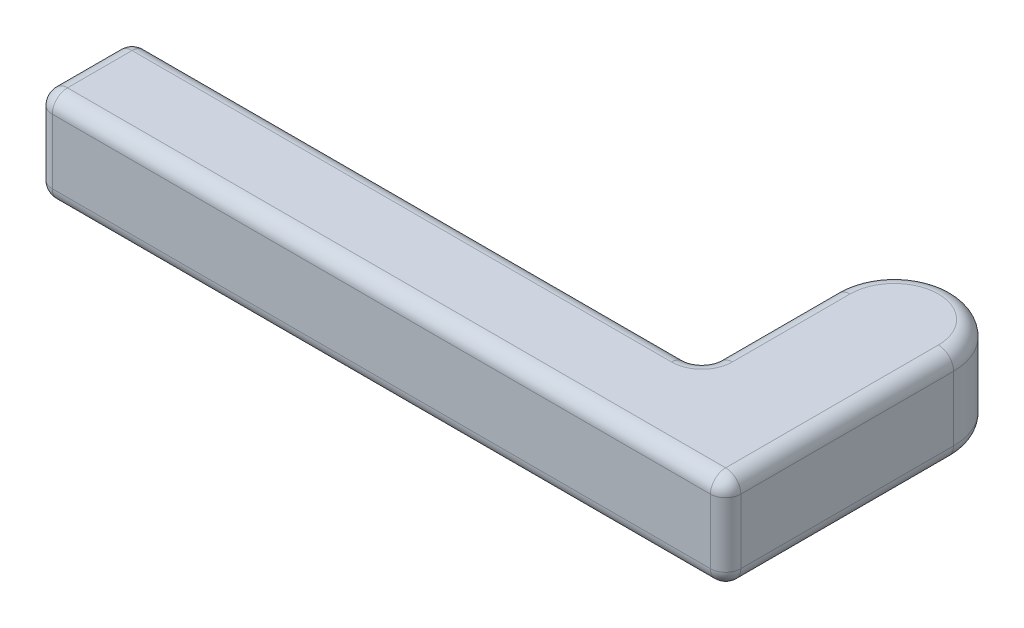
ISO-10303-21;
HEADER;
FILE_DESCRIPTION(('STEP AP214'),'2;1');
FILE_NAME('part.step','',(''),(''),'','','');
FILE_SCHEMA(('AUTOMOTIVE_DESIGN { 1 0 10303 214 1 1 1 1 }'));
ENDSEC;
DATA;
#1=APPLICATION_CONTEXT('core data for automotive mechanical design processes');
#2=APPLICATION_PROTOCOL_DEFINITION('international standard','automotive_design',2000,#1);
#3=PRODUCT_CONTEXT('',#1,'mechanical');
#4=PRODUCT('Part','Part','',(#3));
#5=PRODUCT_RELATED_PRODUCT_CATEGORY('part','',(#4));
#6=PRODUCT_DEFINITION_FORMATION('','',#4);
#7=PRODUCT_DEFINITION_CONTEXT('part definition',#1,'design');
#8=PRODUCT_DEFINITION('design','',#6,#7);
#9=PRODUCT_DEFINITION_SHAPE('','',#8);
#10=(LENGTH_UNIT() NAMED_UNIT(*) SI_UNIT(.MILLI.,.METRE.));
#11=(NAMED_UNIT(*) PLANE_ANGLE_UNIT() SI_UNIT($,.RADIAN.));
#12=(NAMED_UNIT(*) SI_UNIT($,.STERADIAN.) SOLID_ANGLE_UNIT());
#13=UNCERTAINTY_MEASURE_WITH_UNIT(LENGTH_MEASURE(1.E-05),#10,'distance_accuracy_value','');
#14=(GEOMETRIC_REPRESENTATION_CONTEXT(3) GLOBAL_UNCERTAINTY_ASSIGNED_CONTEXT((#13)) GLOBAL_UNIT_ASSIGNED_CONTEXT((#10,
#11,#12)) REPRESENTATION_CONTEXT('',''));
#15=CARTESIAN_POINT('',(0.,0.,0.));
#16=DIRECTION('',(0.,0.,1.));
#17=DIRECTION('',(1.,0.,0.));
#18=AXIS2_PLACEMENT_3D('',#15,#16,#17);
#19=CARTESIAN_POINT('',(70.7701006316034,12.7,-30.48));
#20=DIRECTION('',(0.,1.,0.));
#21=DIRECTION('',(0.,0.,1.));
#22=AXIS2_PLACEMENT_3D('',#19,#20,#21);
#23=PLANE('',#22);
#24=CARTESIAN_POINT('',(60.8006006316034,12.7,-14.732));
#25=DIRECTION('',(0.,1.,0.));
#26=DIRECTION('',(0.,0.,1.));
#27=AXIS2_PLACEMENT_3D('',#24,#25,#26);
#28=CIRCLE('',#27,4.064);
#29=CARTESIAN_POINT('',(60.8006006316034,12.7,-10.668));
#30=VERTEX_POINT('',#29);
#31=CARTESIAN_POINT('',(64.8646006316034,12.7,-14.732));
#32=VERTEX_POINT('',#31);
#33=EDGE_CURVE('E11',#30,#32,#28,.T.);
#34=ORIENTED_EDGE('',*,*,#33,.F.);
#35=DIRECTION('',(-1.,0.,0.));
#36=VECTOR('',#35,1.);
#37=CARTESIAN_POINT('',(-13.3673993683966,12.7,-10.668));
#38=LINE('',#37,#36);
#39=CARTESIAN_POINT('',(-11.3353993683966,12.7,-10.668));
#40=VERTEX_POINT('',#39);
#41=EDGE_CURVE('E55',#30,#40,#38,.T.);
#42=ORIENTED_EDGE('',*,*,#41,.T.);
#43=DIRECTION('',(0.,0.,1.));
#44=VECTOR('',#43,1.);
#45=CARTESIAN_POINT('',(-11.3353993683966,12.7,0.));
#46=LINE('',#45,#44);
#47=CARTESIAN_POINT('',(-11.3353993683966,12.7,-2.032));
#48=VERTEX_POINT('',#47);
#49=EDGE_CURVE('E282',#40,#48,#46,.T.);
#50=ORIENTED_EDGE('',*,*,#49,.T.);
#51=DIRECTION('',(1.,0.,0.));
#52=VECTOR('',#51,1.);
#53=CARTESIAN_POINT('',(78.7076006316034,12.7,-2.032));
#54=LINE('',#53,#52);
#55=CARTESIAN_POINT('',(76.6756006316034,12.7,-2.032));
#56=VERTEX_POINT('',#55);
#57=EDGE_CURVE('E285',#48,#56,#54,.T.);
#58=ORIENTED_EDGE('',*,*,#57,.T.);
#59=DIRECTION('',(0.,0.,-1.));
#60=VECTOR('',#59,1.);
#61=CARTESIAN_POINT('',(76.6756006316034,12.7,-30.48));
#62=LINE('',#61,#60);
#63=CARTESIAN_POINT('',(76.6756006316034,12.7,-30.48));
#64=VERTEX_POINT('',#63);
#65=EDGE_CURVE('E288',#56,#64,#62,.T.);
#66=ORIENTED_EDGE('',*,*,#65,.T.);
#67=CARTESIAN_POINT('',(70.7701006316034,12.7,-30.48));
#68=DIRECTION('',(0.,1.,0.));
#69=DIRECTION('',(0.,0.,1.));
#70=AXIS2_PLACEMENT_3D('',#67,#68,#69);
#71=CIRCLE('',#70,5.90550000000001);
#72=CARTESIAN_POINT('',(64.8646006316034,12.7,-30.48));
#73=VERTEX_POINT('',#72);
#74=EDGE_CURVE('E291',#64,#73,#71,.T.);
#75=ORIENTED_EDGE('',*,*,#74,.T.);
#76=DIRECTION('',(0.,0.,1.));
#77=VECTOR('',#76,1.);
#78=CARTESIAN_POINT('',(64.8646006316034,12.7,-12.7));
#79=LINE('',#78,#77);
#80=EDGE_CURVE('E66',#73,#32,#79,.T.);
#81=ORIENTED_EDGE('',*,*,#80,.T.);
#82=EDGE_LOOP('',(#34,#42,#50,#58,#66,#75,#81));
#83=FACE_BOUND('',#82,.T.);
#84=ADVANCED_FACE('F45',(#83),#23,.T.);
#85=CARTESIAN_POINT('',(-13.3673993683966,12.7,-12.7));
#86=DIRECTION('',(1.,0.,0.));
#87=DIRECTION('',(0.,0.,-1.));
#88=AXIS2_PLACEMENT_3D('',#85,#86,#87);
#89=PLANE('',#88);
#90=DIRECTION('',(0.,0.,1.));
#91=VECTOR('',#90,1.);
#92=CARTESIAN_POINT('',(-13.3673993683966,2.032,-12.7));
#93=LINE('',#92,#91);
#94=CARTESIAN_POINT('',(-13.3673993683966,2.032,-10.668));
#95=VERTEX_POINT('',#94);
#96=CARTESIAN_POINT('',(-13.3673993683966,2.032,-2.032));
#97=VERTEX_POINT('',#96);
#98=EDGE_CURVE('E275',#95,#97,#93,.T.);
#99=ORIENTED_EDGE('',*,*,#98,.T.);
#100=DIRECTION('',(0.,-1.,0.));
#101=VECTOR('',#100,1.);
#102=CARTESIAN_POINT('',(-13.3673993683966,12.7,-2.032));
#103=LINE('',#102,#101);
#104=CARTESIAN_POINT('',(-13.3673993683966,10.668,-2.032));
#105=VERTEX_POINT('',#104);
#106=EDGE_CURVE('E279',#97,#105,#103,.F.);
#107=ORIENTED_EDGE('',*,*,#106,.T.);
#108=DIRECTION('',(0.,0.,1.));
#109=VECTOR('',#108,1.);
#110=CARTESIAN_POINT('',(-13.3673993683966,10.668,-12.7));
#111=LINE('',#110,#109);
#112=CARTESIAN_POINT('',(-13.3673993683966,10.668,-10.668));
#113=VERTEX_POINT('',#112);
#114=EDGE_CURVE('E272',#105,#113,#111,.F.);
#115=ORIENTED_EDGE('',*,*,#114,.T.);
#116=DIRECTION('',(0.,-1.,0.));
#117=VECTOR('',#116,1.);
#118=CARTESIAN_POINT('',(-13.3673993683966,12.7,-10.668));
#119=LINE('',#118,#117);
#120=EDGE_CURVE('E269',#113,#95,#119,.T.);
#121=ORIENTED_EDGE('',*,*,#120,.T.);
#122=EDGE_LOOP('',(#99,#107,#115,#121));
#123=FACE_BOUND('',#122,.T.);
#124=ADVANCED_FACE('F466',(#123),#89,.F.);
#125=CARTESIAN_POINT('',(-13.3673993683966,12.7,0.));
#126=DIRECTION('',(0.,0.,-1.));
#127=DIRECTION('',(-1.,0.,0.));
#128=AXIS2_PLACEMENT_3D('',#125,#126,#127);
#129=PLANE('',#128);
#130=DIRECTION('',(1.,0.,0.));
#131=VECTOR('',#130,1.);
#132=CARTESIAN_POINT('',(-13.3673993683966,10.668,0.));
#133=LINE('',#132,#131);
#134=CARTESIAN_POINT('',(76.6756006316034,10.668,0.));
#135=VERTEX_POINT('',#134);
#136=CARTESIAN_POINT('',(-11.3353993683966,10.668,0.));
#137=VERTEX_POINT('',#136);
#138=EDGE_CURVE('E196',#135,#137,#133,.F.);
#139=ORIENTED_EDGE('',*,*,#138,.T.);
#140=DIRECTION('',(0.,-1.,0.));
#141=VECTOR('',#140,1.);
#142=CARTESIAN_POINT('',(-11.3353993683966,12.7,0.));
#143=LINE('',#142,#141);
#144=CARTESIAN_POINT('',(-11.3353993683966,2.032,0.));
#145=VERTEX_POINT('',#144);
#146=EDGE_CURVE('E201',#137,#145,#143,.T.);
#147=ORIENTED_EDGE('',*,*,#146,.T.);
#148=DIRECTION('',(1.,0.,0.));
#149=VECTOR('',#148,1.);
#150=CARTESIAN_POINT('',(-13.3673993683966,2.032,0.));
#151=LINE('',#150,#149);
#152=CARTESIAN_POINT('',(76.6756006316034,2.032,0.));
#153=VERTEX_POINT('',#152);
#154=EDGE_CURVE('E169',#145,#153,#151,.T.);
#155=ORIENTED_EDGE('',*,*,#154,.T.);
#156=DIRECTION('',(0.,-1.,0.));
#157=VECTOR('',#156,1.);
#158=CARTESIAN_POINT('',(76.6756006316034,12.7,0.));
#159=LINE('',#158,#157);
#160=EDGE_CURVE('E189',#153,#135,#159,.F.);
#161=ORIENTED_EDGE('',*,*,#160,.T.);
#162=EDGE_LOOP('',(#139,#147,#155,#161));
#163=FACE_BOUND('',#162,.T.);
#164=ADVANCED_FACE('F199',(#163),#129,.F.);
#165=CARTESIAN_POINT('',(78.7076006316034,12.7,-30.48));
#166=DIRECTION('',(-1.,0.,0.));
#167=DIRECTION('',(0.,0.,1.));
#168=AXIS2_PLACEMENT_3D('',#165,#166,#167);
#169=PLANE('',#168);
#170=DIRECTION('',(0.,-1.,0.));
#171=VECTOR('',#170,1.);
#172=CARTESIAN_POINT('',(78.7076006316034,12.7,-2.032));
#173=LINE('',#172,#171);
#174=CARTESIAN_POINT('',(78.7076006316034,10.668,-2.032));
#175=VERTEX_POINT('',#174);
#176=CARTESIAN_POINT('',(78.7076006316034,2.032,-2.032));
#177=VERTEX_POINT('',#176);
#178=EDGE_CURVE('E231',#175,#177,#173,.T.);
#179=ORIENTED_EDGE('',*,*,#178,.T.);
#180=DIRECTION('',(0.,0.,-1.));
#181=VECTOR('',#180,1.);
#182=CARTESIAN_POINT('',(78.7076006316034,2.032,-30.48));
#183=LINE('',#182,#181);
#184=CARTESIAN_POINT('',(78.7076006316034,2.032,-30.48));
#185=VERTEX_POINT('',#184);
#186=EDGE_CURVE('E237',#177,#185,#183,.T.);
#187=ORIENTED_EDGE('',*,*,#186,.T.);
#188=DIRECTION('',(0.,-1.,0.));
#189=VECTOR('',#188,1.);
#190=CARTESIAN_POINT('',(78.7076006316034,12.7,-30.48));
#191=LINE('',#190,#189);
#192=CARTESIAN_POINT('',(78.7076006316034,10.668,-30.48));
#193=VERTEX_POINT('',#192);
#194=EDGE_CURVE('E197',#193,#185,#191,.T.);
#195=ORIENTED_EDGE('',*,*,#194,.F.);
#196=DIRECTION('',(0.,0.,-1.));
#197=VECTOR('',#196,1.);
#198=CARTESIAN_POINT('',(78.7076006316034,10.668,0.));
#199=LINE('',#198,#197);
#200=EDGE_CURVE('E234',#193,#175,#199,.F.);
#201=ORIENTED_EDGE('',*,*,#200,.T.);
#202=EDGE_LOOP('',(#179,#187,#195,#201));
#203=FACE_BOUND('',#202,.T.);
#204=ADVANCED_FACE('F412',(#203),#169,.F.);
#205=CARTESIAN_POINT('',(70.7701006316034,12.7,-30.48));
#206=DIRECTION('',(0.,-1.,0.));
#207=DIRECTION('',(0.,0.,-1.));
#208=AXIS2_PLACEMENT_3D('',#205,#206,#207);
#209=CYLINDRICAL_SURFACE('',#208,7.93750000000001);
#210=ORIENTED_EDGE('',*,*,#194,.T.);
#211=CARTESIAN_POINT('',(70.7701006316034,2.032,-30.48));
#212=DIRECTION('',(0.,1.,0.));
#213=DIRECTION('',(0.,0.,1.));
#214=AXIS2_PLACEMENT_3D('',#211,#212,#213);
#215=CIRCLE('',#214,7.93750000000001);
#216=CARTESIAN_POINT('',(62.8326006316034,2.032,-30.48));
#217=VERTEX_POINT('',#216);
#218=EDGE_CURVE('E244',#185,#217,#215,.T.);
#219=ORIENTED_EDGE('',*,*,#218,.T.);
#220=DIRECTION('',(0.,-1.,0.));
#221=VECTOR('',#220,1.);
#222=CARTESIAN_POINT('',(62.8326006316034,12.7,-30.48));
#223=LINE('',#222,#221);
#224=CARTESIAN_POINT('',(62.8326006316034,10.668,-30.48));
#225=VERTEX_POINT('',#224);
#226=EDGE_CURVE('E391',#225,#217,#223,.T.);
#227=ORIENTED_EDGE('',*,*,#226,.F.);
#228=CARTESIAN_POINT('',(70.7701006316034,10.668,-30.48));
#229=DIRECTION('',(0.,1.,0.));
#230=DIRECTION('',(0.,0.,1.));
#231=AXIS2_PLACEMENT_3D('',#228,#229,#230);
#232=CIRCLE('',#231,7.93750000000001);
#233=EDGE_CURVE('E241',#225,#193,#232,.F.);
#234=ORIENTED_EDGE('',*,*,#233,.T.);
#235=EDGE_LOOP('',(#210,#219,#227,#234));
#236=FACE_BOUND('',#235,.T.);
#237=ADVANCED_FACE('F407',(#236),#209,.T.);
#238=CARTESIAN_POINT('',(62.8326006316034,12.7,-12.7));
#239=DIRECTION('',(1.,0.,0.));
#240=DIRECTION('',(0.,0.,-1.));
#241=AXIS2_PLACEMENT_3D('',#238,#239,#240);
#242=PLANE('',#241);
#243=ORIENTED_EDGE('',*,*,#226,.T.);
#244=DIRECTION('',(0.,0.,1.));
#245=VECTOR('',#244,1.);
#246=CARTESIAN_POINT('',(62.8326006316034,2.032,-12.7));
#247=LINE('',#246,#245);
#248=CARTESIAN_POINT('',(62.8326006316034,2.032,-14.732));
#249=VERTEX_POINT('',#248);
#250=EDGE_CURVE('E253',#217,#249,#247,.T.);
#251=ORIENTED_EDGE('',*,*,#250,.T.);
#252=DIRECTION('',(0.,-1.,0.));
#253=VECTOR('',#252,1.);
#254=CARTESIAN_POINT('',(62.8326006316034,12.7,-14.732));
#255=LINE('',#254,#253);
#256=CARTESIAN_POINT('',(62.8326006316034,10.668,-14.732));
#257=VERTEX_POINT('',#256);
#258=EDGE_CURVE('E247',#249,#257,#255,.F.);
#259=ORIENTED_EDGE('',*,*,#258,.T.);
#260=DIRECTION('',(0.,0.,1.));
#261=VECTOR('',#260,1.);
#262=CARTESIAN_POINT('',(62.8326006316034,10.668,-30.48));
#263=LINE('',#262,#261);
#264=EDGE_CURVE('E250',#257,#225,#263,.F.);
#265=ORIENTED_EDGE('',*,*,#264,.T.);
#266=EDGE_LOOP('',(#243,#251,#259,#265));
#267=FACE_BOUND('',#266,.T.);
#268=ADVANCED_FACE('F438',(#267),#242,.F.);
#269=CARTESIAN_POINT('',(62.8326006316034,12.7,-12.7));
#270=DIRECTION('',(0.,0.,1.));
#271=DIRECTION('',(1.,0.,0.));
#272=AXIS2_PLACEMENT_3D('',#269,#270,#271);
#273=PLANE('',#272);
#274=DIRECTION('',(-1.,0.,0.));
#275=VECTOR('',#274,1.);
#276=CARTESIAN_POINT('',(62.8326006316034,2.032,-12.7));
#277=LINE('',#276,#275);
#278=CARTESIAN_POINT('',(60.8006006316034,2.032,-12.7));
#279=VERTEX_POINT('',#278);
#280=CARTESIAN_POINT('',(-11.3353993683966,2.032,-12.7));
#281=VERTEX_POINT('',#280);
#282=EDGE_CURVE('E262',#279,#281,#277,.T.);
#283=ORIENTED_EDGE('',*,*,#282,.T.);
#284=DIRECTION('',(0.,-1.,0.));
#285=VECTOR('',#284,1.);
#286=CARTESIAN_POINT('',(-11.3353993683966,12.7,-12.7));
#287=LINE('',#286,#285);
#288=CARTESIAN_POINT('',(-11.3353993683966,10.668,-12.7));
#289=VERTEX_POINT('',#288);
#290=EDGE_CURVE('E266',#281,#289,#287,.F.);
#291=ORIENTED_EDGE('',*,*,#290,.T.);
#292=DIRECTION('',(-1.,0.,0.));
#293=VECTOR('',#292,1.);
#294=CARTESIAN_POINT('',(62.8326006316034,10.668,-12.7));
#295=LINE('',#294,#293);
#296=CARTESIAN_POINT('',(60.8006006316034,10.668,-12.7));
#297=VERTEX_POINT('',#296);
#298=EDGE_CURVE('E259',#289,#297,#295,.F.);
#299=ORIENTED_EDGE('',*,*,#298,.T.);
#300=DIRECTION('',(0.,-1.,0.));
#301=VECTOR('',#300,1.);
#302=CARTESIAN_POINT('',(60.8006006316034,0.,-12.7));
#303=LINE('',#302,#301);
#304=EDGE_CURVE('E256',#297,#279,#303,.T.);
#305=ORIENTED_EDGE('',*,*,#304,.T.);
#306=EDGE_LOOP('',(#283,#291,#299,#305));
#307=FACE_BOUND('',#306,.T.);
#308=ADVANCED_FACE('F453',(#307),#273,.F.);
#309=CARTESIAN_POINT('',(70.7701006316034,0.,-30.48));
#310=DIRECTION('',(0.,1.,0.));
#311=DIRECTION('',(0.,0.,1.));
#312=AXIS2_PLACEMENT_3D('',#309,#310,#311);
#313=PLANE('',#312);
#314=CARTESIAN_POINT('',(70.7701006316034,0.,-30.48));
#315=DIRECTION('',(0.,1.,0.));
#316=DIRECTION('',(0.,0.,1.));
#317=AXIS2_PLACEMENT_3D('',#314,#315,#316);
#318=CIRCLE('',#317,5.90550000000001);
#319=CARTESIAN_POINT('',(64.8646006316034,0.,-30.48));
#320=VERTEX_POINT('',#319);
#321=CARTESIAN_POINT('',(76.6756006316034,0.,-30.48));
#322=VERTEX_POINT('',#321);
#323=EDGE_CURVE('E225',#320,#322,#318,.F.);
#324=ORIENTED_EDGE('',*,*,#323,.T.);
#325=DIRECTION('',(0.,0.,-1.));
#326=VECTOR('',#325,1.);
#327=CARTESIAN_POINT('',(76.6756006316034,0.,-30.48));
#328=LINE('',#327,#326);
#329=CARTESIAN_POINT('',(76.6756006316034,0.,-2.032));
#330=VERTEX_POINT('',#329);
#331=EDGE_CURVE('E228',#322,#330,#328,.F.);
#332=ORIENTED_EDGE('',*,*,#331,.T.);
#333=DIRECTION('',(1.,0.,0.));
#334=VECTOR('',#333,1.);
#335=CARTESIAN_POINT('',(70.7701006316034,0.,-2.032));
#336=LINE('',#335,#334);
#337=CARTESIAN_POINT('',(-11.3353993683966,0.,-2.032));
#338=VERTEX_POINT('',#337);
#339=EDGE_CURVE('E171',#330,#338,#336,.F.);
#340=ORIENTED_EDGE('',*,*,#339,.T.);
#341=DIRECTION('',(0.,0.,1.));
#342=VECTOR('',#341,1.);
#343=CARTESIAN_POINT('',(-11.3353993683966,0.,-30.48));
#344=LINE('',#343,#342);
#345=CARTESIAN_POINT('',(-11.3353993683966,0.,-10.668));
#346=VERTEX_POINT('',#345);
#347=EDGE_CURVE('E207',#338,#346,#344,.F.);
#348=ORIENTED_EDGE('',*,*,#347,.T.);
#349=DIRECTION('',(-1.,0.,0.));
#350=VECTOR('',#349,1.);
#351=CARTESIAN_POINT('',(70.7701006316034,0.,-10.668));
#352=LINE('',#351,#350);
#353=CARTESIAN_POINT('',(60.8006006316034,0.,-10.668));
#354=VERTEX_POINT('',#353);
#355=EDGE_CURVE('E213',#346,#354,#352,.F.);
#356=ORIENTED_EDGE('',*,*,#355,.T.);
#357=CARTESIAN_POINT('',(60.8006006316034,0.,-14.732));
#358=DIRECTION('',(0.,1.,0.));
#359=DIRECTION('',(0.,0.,1.));
#360=AXIS2_PLACEMENT_3D('',#357,#358,#359);
#361=CIRCLE('',#360,4.064);
#362=CARTESIAN_POINT('',(64.8646006316034,0.,-14.732));
#363=VERTEX_POINT('',#362);
#364=EDGE_CURVE('E218',#363,#354,#361,.F.);
#365=ORIENTED_EDGE('',*,*,#364,.F.);
#366=DIRECTION('',(0.,0.,1.));
#367=VECTOR('',#366,1.);
#368=CARTESIAN_POINT('',(64.8646006316034,0.,-30.48));
#369=LINE('',#368,#367);
#370=EDGE_CURVE('E222',#363,#320,#369,.F.);
#371=ORIENTED_EDGE('',*,*,#370,.T.);
#372=EDGE_LOOP('',(#324,#332,#340,#348,#356,#365,#371));
#373=FACE_BOUND('',#372,.T.);
#374=ADVANCED_FACE('F490',(#373),#313,.F.);
#375=CARTESIAN_POINT('',(60.8006006316034,10.668,-14.732));
#376=DIRECTION('',(0.,1.,0.));
#377=DIRECTION('',(0.,0.,1.));
#378=AXIS2_PLACEMENT_3D('',#375,#376,#377);
#379=TOROIDAL_SURFACE('',#378,4.064,2.032);
#380=CARTESIAN_POINT('',(60.8006006316034,10.668,-14.732));
#381=DIRECTION('',(0.,1.,0.));
#382=DIRECTION('',(0.,0.,1.));
#383=AXIS2_PLACEMENT_3D('',#380,#381,#382);
#384=CIRCLE('',#383,2.032);
#385=EDGE_CURVE('E380',#297,#257,#384,.T.);
#386=ORIENTED_EDGE('',*,*,#385,.F.);
#387=CARTESIAN_POINT('',(60.8006006316034,10.668,-10.668));
#388=DIRECTION('',(1.,0.,0.));
#389=DIRECTION('',(0.,0.,-1.));
#390=AXIS2_PLACEMENT_3D('',#387,#388,#389);
#391=CIRCLE('',#390,2.032);
#392=EDGE_CURVE('E49',#30,#297,#391,.F.);
#393=ORIENTED_EDGE('',*,*,#392,.F.);
#394=ORIENTED_EDGE('',*,*,#33,.T.);
#395=CARTESIAN_POINT('',(64.8646006316034,10.668,-14.732));
#396=DIRECTION('',(0.,0.,1.));
#397=DIRECTION('',(1.,0.,0.));
#398=AXIS2_PLACEMENT_3D('',#395,#396,#397);
#399=CIRCLE('',#398,2.032);
#400=EDGE_CURVE('E383',#257,#32,#399,.F.);
#401=ORIENTED_EDGE('',*,*,#400,.F.);
#402=EDGE_LOOP('',(#386,#393,#394,#401));
#403=FACE_BOUND('',#402,.T.);
#404=ADVANCED_FACE('F47',(#403),#379,.T.);
#405=CARTESIAN_POINT('',(70.7701006316034,10.668,-10.668));
#406=DIRECTION('',(1.,0.,0.));
#407=DIRECTION('',(0.,0.,-1.));
#408=AXIS2_PLACEMENT_3D('',#405,#406,#407);
#409=CYLINDRICAL_SURFACE('',#408,2.032);
#410=ORIENTED_EDGE('',*,*,#392,.T.);
#411=ORIENTED_EDGE('',*,*,#298,.F.);
#412=CARTESIAN_POINT('',(-11.3353993683966,10.668,-10.668));
#413=DIRECTION('',(-1.,0.,0.));
#414=DIRECTION('',(0.,0.,1.));
#415=AXIS2_PLACEMENT_3D('',#412,#413,#414);
#416=CIRCLE('',#415,2.032);
#417=EDGE_CURVE('E376',#40,#289,#416,.T.);
#418=ORIENTED_EDGE('',*,*,#417,.F.);
#419=ORIENTED_EDGE('',*,*,#41,.F.);
#420=EDGE_LOOP('',(#410,#411,#418,#419));
#421=FACE_BOUND('',#420,.T.);
#422=ADVANCED_FACE('F455',(#421),#409,.T.);
#423=CARTESIAN_POINT('',(64.8646006316034,10.668,-30.48));
#424=DIRECTION('',(0.,0.,-1.));
#425=DIRECTION('',(-1.,0.,0.));
#426=AXIS2_PLACEMENT_3D('',#423,#424,#425);
#427=CYLINDRICAL_SURFACE('',#426,2.032);
#428=ORIENTED_EDGE('',*,*,#400,.T.);
#429=ORIENTED_EDGE('',*,*,#80,.F.);
#430=CARTESIAN_POINT('',(64.8646006316034,10.668,-30.48));
#431=DIRECTION('',(0.,0.,-1.));
#432=DIRECTION('',(-1.,0.,0.));
#433=AXIS2_PLACEMENT_3D('',#430,#431,#432);
#434=CIRCLE('',#433,2.032);
#435=EDGE_CURVE('E372',#225,#73,#434,.T.);
#436=ORIENTED_EDGE('',*,*,#435,.F.);
#437=ORIENTED_EDGE('',*,*,#264,.F.);
#438=EDGE_LOOP('',(#428,#429,#436,#437));
#439=FACE_BOUND('',#438,.T.);
#440=ADVANCED_FACE('F667',(#439),#427,.T.);
#441=CARTESIAN_POINT('',(60.8006006316034,12.7,-14.732));
#442=DIRECTION('',(0.,1.,0.));
#443=DIRECTION('',(0.,0.,1.));
#444=AXIS2_PLACEMENT_3D('',#441,#442,#443);
#445=CYLINDRICAL_SURFACE('',#444,2.032);
#446=ORIENTED_EDGE('',*,*,#385,.T.);
#447=ORIENTED_EDGE('',*,*,#258,.F.);
#448=CARTESIAN_POINT('',(60.8006006316034,2.032,-14.732));
#449=DIRECTION('',(0.,1.,0.));
#450=DIRECTION('',(0.,0.,1.));
#451=AXIS2_PLACEMENT_3D('',#448,#449,#450);
#452=CIRCLE('',#451,2.032);
#453=EDGE_CURVE('E368',#279,#249,#452,.T.);
#454=ORIENTED_EDGE('',*,*,#453,.F.);
#455=ORIENTED_EDGE('',*,*,#304,.F.);
#456=EDGE_LOOP('',(#446,#447,#454,#455));
#457=FACE_BOUND('',#456,.T.);
#458=ADVANCED_FACE('F441',(#457),#445,.F.);
#459=CARTESIAN_POINT('',(-11.3353993683966,10.668,-10.668));
#460=DIRECTION('',(0.,0.,-1.));
#461=DIRECTION('',(-1.,0.,0.));
#462=AXIS2_PLACEMENT_3D('',#459,#460,#461);
#463=SPHERICAL_SURFACE('',#462,2.032);
#464=CARTESIAN_POINT('',(-11.3353993683966,10.668,-10.668));
#465=DIRECTION('',(0.,0.,-1.));
#466=DIRECTION('',(0.,1.,0.));
#467=AXIS2_PLACEMENT_3D('',#464,#465,#466);
#468=CIRCLE('',#467,2.032);
#469=EDGE_CURVE('E356',#40,#113,#468,.F.);
#470=ORIENTED_EDGE('',*,*,#469,.F.);
#471=ORIENTED_EDGE('',*,*,#417,.T.);
#472=CARTESIAN_POINT('',(-11.3353993683966,10.668,-10.668));
#473=DIRECTION('',(0.,1.,0.));
#474=DIRECTION('',(0.,0.,1.));
#475=AXIS2_PLACEMENT_3D('',#472,#473,#474);
#476=CIRCLE('',#475,2.032);
#477=EDGE_CURVE('E360',#113,#289,#476,.F.);
#478=ORIENTED_EDGE('',*,*,#477,.F.);
#479=EDGE_LOOP('',(#470,#471,#478));
#480=FACE_BOUND('',#479,.T.);
#481=ADVANCED_FACE('F459',(#480),#463,.T.);
#482=CARTESIAN_POINT('',(70.7701006316034,10.668,-30.48));
#483=DIRECTION('',(0.,1.,0.));
#484=DIRECTION('',(0.,0.,1.));
#485=AXIS2_PLACEMENT_3D('',#482,#483,#484);
#486=TOROIDAL_SURFACE('',#485,5.90550000000001,2.032);
#487=ORIENTED_EDGE('',*,*,#435,.T.);
#488=ORIENTED_EDGE('',*,*,#74,.F.);
#489=CARTESIAN_POINT('',(76.6756006316034,10.668,-30.48));
#490=DIRECTION('',(0.,0.,1.));
#491=DIRECTION('',(1.,0.,0.));
#492=AXIS2_PLACEMENT_3D('',#489,#490,#491);
#493=CIRCLE('',#492,2.032);
#494=EDGE_CURVE('E352',#193,#64,#493,.T.);
#495=ORIENTED_EDGE('',*,*,#494,.F.);
#496=ORIENTED_EDGE('',*,*,#233,.F.);
#497=EDGE_LOOP('',(#487,#488,#495,#496));
#498=FACE_BOUND('',#497,.T.);
#499=ADVANCED_FACE('F418',(#498),#486,.T.);
#500=CARTESIAN_POINT('',(60.8006006316034,2.032,-14.732));
#501=DIRECTION('',(0.,1.,0.));
#502=DIRECTION('',(0.,0.,1.));
#503=AXIS2_PLACEMENT_3D('',#500,#501,#502);
#504=TOROIDAL_SURFACE('',#503,4.064,2.032);
#505=CARTESIAN_POINT('',(64.8646006316034,2.032,-14.732));
#506=DIRECTION('',(0.,0.,1.));
#507=DIRECTION('',(1.,0.,0.));
#508=AXIS2_PLACEMENT_3D('',#505,#506,#507);
#509=CIRCLE('',#508,2.032);
#510=EDGE_CURVE('E348',#363,#249,#509,.F.);
#511=ORIENTED_EDGE('',*,*,#510,.F.);
#512=ORIENTED_EDGE('',*,*,#364,.T.);
#513=CARTESIAN_POINT('',(60.8006006316034,2.032,-10.668));
#514=DIRECTION('',(1.,0.,0.));
#515=DIRECTION('',(0.,0.,-1.));
#516=AXIS2_PLACEMENT_3D('',#513,#514,#515);
#517=CIRCLE('',#516,2.032);
#518=EDGE_CURVE('E364',#279,#354,#517,.F.);
#519=ORIENTED_EDGE('',*,*,#518,.F.);
#520=ORIENTED_EDGE('',*,*,#453,.T.);
#521=EDGE_LOOP('',(#511,#512,#519,#520));
#522=FACE_BOUND('',#521,.T.);
#523=ADVANCED_FACE('F445',(#522),#504,.T.);
#524=CARTESIAN_POINT('',(62.8326006316034,2.032,-10.668));
#525=DIRECTION('',(-1.,0.,0.));
#526=DIRECTION('',(0.,0.,1.));
#527=AXIS2_PLACEMENT_3D('',#524,#525,#526);
#528=CYLINDRICAL_SURFACE('',#527,2.032);
#529=ORIENTED_EDGE('',*,*,#518,.T.);
#530=ORIENTED_EDGE('',*,*,#355,.F.);
#531=CARTESIAN_POINT('',(-11.3353993683966,2.032,-10.668));
#532=DIRECTION('',(-1.,0.,0.));
#533=DIRECTION('',(0.,0.,1.));
#534=AXIS2_PLACEMENT_3D('',#531,#532,#533);
#535=CIRCLE('',#534,2.032);
#536=EDGE_CURVE('E344',#281,#346,#535,.T.);
#537=ORIENTED_EDGE('',*,*,#536,.F.);
#538=ORIENTED_EDGE('',*,*,#282,.F.);
#539=EDGE_LOOP('',(#529,#530,#537,#538));
#540=FACE_BOUND('',#539,.T.);
#541=ADVANCED_FACE('F450',(#540),#528,.T.);
#542=CARTESIAN_POINT('',(-11.3353993683966,12.7,-10.668));
#543=DIRECTION('',(0.,-1.,0.));
#544=DIRECTION('',(0.,0.,-1.));
#545=AXIS2_PLACEMENT_3D('',#542,#543,#544);
#546=CYLINDRICAL_SURFACE('',#545,2.032);
#547=ORIENTED_EDGE('',*,*,#477,.T.);
#548=ORIENTED_EDGE('',*,*,#290,.F.);
#549=CARTESIAN_POINT('',(-11.3353993683966,2.032,-10.668));
#550=DIRECTION('',(0.,-1.,0.));
#551=DIRECTION('',(0.,0.,-1.));
#552=AXIS2_PLACEMENT_3D('',#549,#550,#551);
#553=CIRCLE('',#552,2.032);
#554=EDGE_CURVE('E341',#95,#281,#553,.T.);
#555=ORIENTED_EDGE('',*,*,#554,.F.);
#556=ORIENTED_EDGE('',*,*,#120,.F.);
#557=EDGE_LOOP('',(#547,#548,#555,#556));
#558=FACE_BOUND('',#557,.T.);
#559=ADVANCED_FACE('F462',(#558),#546,.T.);
#560=CARTESIAN_POINT('',(-11.3353993683966,10.668,-30.48));
#561=DIRECTION('',(0.,0.,-1.));
#562=DIRECTION('',(-1.,0.,0.));
#563=AXIS2_PLACEMENT_3D('',#560,#561,#562);
#564=CYLINDRICAL_SURFACE('',#563,2.032);
#565=ORIENTED_EDGE('',*,*,#469,.T.);
#566=ORIENTED_EDGE('',*,*,#114,.F.);
#567=CARTESIAN_POINT('',(-11.3353993683966,10.668,-2.032));
#568=DIRECTION('',(0.,0.,1.));
#569=DIRECTION('',(1.,0.,0.));
#570=AXIS2_PLACEMENT_3D('',#567,#568,#569);
#571=CIRCLE('',#570,2.032);
#572=EDGE_CURVE('E337',#48,#105,#571,.T.);
#573=ORIENTED_EDGE('',*,*,#572,.F.);
#574=ORIENTED_EDGE('',*,*,#49,.F.);
#575=EDGE_LOOP('',(#565,#566,#573,#574));
#576=FACE_BOUND('',#575,.T.);
#577=ADVANCED_FACE('F472',(#576),#564,.T.);
#578=CARTESIAN_POINT('',(70.7701006316034,10.668,-2.032));
#579=DIRECTION('',(-1.,0.,0.));
#580=DIRECTION('',(0.,0.,1.));
#581=AXIS2_PLACEMENT_3D('',#578,#579,#580);
#582=CYLINDRICAL_SURFACE('',#581,2.032);
#583=CARTESIAN_POINT('',(76.6756006316034,10.668,-2.032));
#584=DIRECTION('',(1.,0.,0.));
#585=DIRECTION('',(0.,0.,-1.));
#586=AXIS2_PLACEMENT_3D('',#583,#584,#585);
#587=CIRCLE('',#586,2.032);
#588=EDGE_CURVE('E329',#56,#135,#587,.T.);
#589=ORIENTED_EDGE('',*,*,#588,.F.);
#590=ORIENTED_EDGE('',*,*,#57,.F.);
#591=CARTESIAN_POINT('',(-11.3353993683966,10.668,-2.032));
#592=DIRECTION('',(-1.,0.,0.));
#593=DIRECTION('',(0.,-1.,0.));
#594=AXIS2_PLACEMENT_3D('',#591,#592,#593);
#595=CIRCLE('',#594,2.032);
#596=EDGE_CURVE('E333',#137,#48,#595,.T.);
#597=ORIENTED_EDGE('',*,*,#596,.F.);
#598=ORIENTED_EDGE('',*,*,#138,.F.);
#599=EDGE_LOOP('',(#589,#590,#597,#598));
#600=FACE_BOUND('',#599,.T.);
#601=ADVANCED_FACE('F476',(#600),#582,.T.);
#602=CARTESIAN_POINT('',(76.6756006316034,10.668,-30.48));
#603=DIRECTION('',(0.,0.,1.));
#604=DIRECTION('',(1.,0.,0.));
#605=AXIS2_PLACEMENT_3D('',#602,#603,#604);
#606=CYLINDRICAL_SURFACE('',#605,2.032);
#607=ORIENTED_EDGE('',*,*,#494,.T.);
#608=ORIENTED_EDGE('',*,*,#65,.F.);
#609=CARTESIAN_POINT('',(76.6756006316034,10.668,-2.032));
#610=DIRECTION('',(0.,0.,1.));
#611=DIRECTION('',(1.,0.,0.));
#612=AXIS2_PLACEMENT_3D('',#609,#610,#611);
#613=CIRCLE('',#612,2.032);
#614=EDGE_CURVE('E325',#175,#56,#613,.T.);
#615=ORIENTED_EDGE('',*,*,#614,.F.);
#616=ORIENTED_EDGE('',*,*,#200,.F.);
#617=EDGE_LOOP('',(#607,#608,#615,#616));
#618=FACE_BOUND('',#617,.T.);
#619=ADVANCED_FACE('F421',(#618),#606,.T.);
#620=CARTESIAN_POINT('',(64.8646006316034,2.032,-12.7));
#621=DIRECTION('',(0.,0.,1.));
#622=DIRECTION('',(1.,0.,0.));
#623=AXIS2_PLACEMENT_3D('',#620,#621,#622);
#624=CYLINDRICAL_SURFACE('',#623,2.032);
#625=ORIENTED_EDGE('',*,*,#510,.T.);
#626=ORIENTED_EDGE('',*,*,#250,.F.);
#627=CARTESIAN_POINT('',(64.8646006316034,2.032,-30.48));
#628=DIRECTION('',(0.,0.,-1.));
#629=DIRECTION('',(-1.,0.,0.));
#630=AXIS2_PLACEMENT_3D('',#627,#628,#629);
#631=CIRCLE('',#630,2.032);
#632=EDGE_CURVE('E321',#320,#217,#631,.T.);
#633=ORIENTED_EDGE('',*,*,#632,.F.);
#634=ORIENTED_EDGE('',*,*,#370,.F.);
#635=EDGE_LOOP('',(#625,#626,#633,#634));
#636=FACE_BOUND('',#635,.T.);
#637=ADVANCED_FACE('F435',(#636),#624,.T.);
#638=CARTESIAN_POINT('',(-11.3353993683966,2.032,-10.668));
#639=DIRECTION('',(0.,0.,-1.));
#640=DIRECTION('',(0.,1.,0.));
#641=AXIS2_PLACEMENT_3D('',#638,#639,#640);
#642=SPHERICAL_SURFACE('',#641,2.032);
#643=ORIENTED_EDGE('',*,*,#554,.T.);
#644=ORIENTED_EDGE('',*,*,#536,.T.);
#645=CARTESIAN_POINT('',(-11.3353993683966,2.032,-10.668));
#646=DIRECTION('',(0.,0.,-1.));
#647=DIRECTION('',(-1.,0.,0.));
#648=AXIS2_PLACEMENT_3D('',#645,#646,#647);
#649=CIRCLE('',#648,2.032);
#650=EDGE_CURVE('E317',#95,#346,#649,.F.);
#651=ORIENTED_EDGE('',*,*,#650,.F.);
#652=EDGE_LOOP('',(#643,#644,#651));
#653=FACE_BOUND('',#652,.T.);
#654=ADVANCED_FACE('F492',(#653),#642,.T.);
#655=CARTESIAN_POINT('',(-11.3353993683966,10.668,-2.032));
#656=DIRECTION('',(0.,1.,0.));
#657=DIRECTION('',(-1.,0.,0.));
#658=AXIS2_PLACEMENT_3D('',#655,#656,#657);
#659=SPHERICAL_SURFACE('',#658,2.032);
#660=ORIENTED_EDGE('',*,*,#596,.T.);
#661=ORIENTED_EDGE('',*,*,#572,.T.);
#662=CARTESIAN_POINT('',(-11.3353993683966,10.668,-2.032));
#663=DIRECTION('',(0.,1.,0.));
#664=DIRECTION('',(0.,0.,1.));
#665=AXIS2_PLACEMENT_3D('',#662,#663,#664);
#666=CIRCLE('',#665,2.032);
#667=EDGE_CURVE('E313',#137,#105,#666,.F.);
#668=ORIENTED_EDGE('',*,*,#667,.F.);
#669=EDGE_LOOP('',(#660,#661,#668));
#670=FACE_BOUND('',#669,.T.);
#671=ADVANCED_FACE('F479',(#670),#659,.T.);
#672=CARTESIAN_POINT('',(76.6756006316034,10.668,-2.032));
#673=DIRECTION('',(0.,1.,0.));
#674=DIRECTION('',(0.,0.,1.));
#675=AXIS2_PLACEMENT_3D('',#672,#673,#674);
#676=SPHERICAL_SURFACE('',#675,2.032);
#677=ORIENTED_EDGE('',*,*,#614,.T.);
#678=ORIENTED_EDGE('',*,*,#588,.T.);
#679=CARTESIAN_POINT('',(76.6756006316034,10.668,-2.032));
#680=DIRECTION('',(0.,1.,0.));
#681=DIRECTION('',(0.,0.,1.));
#682=AXIS2_PLACEMENT_3D('',#679,#680,#681);
#683=CIRCLE('',#682,2.032);
#684=EDGE_CURVE('E192',#175,#135,#683,.F.);
#685=ORIENTED_EDGE('',*,*,#684,.F.);
#686=EDGE_LOOP('',(#677,#678,#685));
#687=FACE_BOUND('',#686,.T.);
#688=ADVANCED_FACE('F424',(#687),#676,.T.);
#689=CARTESIAN_POINT('',(70.7701006316034,2.032,-30.48));
#690=DIRECTION('',(0.,1.,0.));
#691=DIRECTION('',(0.,0.,1.));
#692=AXIS2_PLACEMENT_3D('',#689,#690,#691);
#693=TOROIDAL_SURFACE('',#692,5.90550000000001,2.032);
#694=ORIENTED_EDGE('',*,*,#632,.T.);
#695=ORIENTED_EDGE('',*,*,#218,.F.);
#696=CARTESIAN_POINT('',(76.6756006316034,2.032,-30.48));
#697=DIRECTION('',(0.,0.,1.));
#698=DIRECTION('',(1.,0.,0.));
#699=AXIS2_PLACEMENT_3D('',#696,#697,#698);
#700=CIRCLE('',#699,2.032);
#701=EDGE_CURVE('E308',#322,#185,#700,.T.);
#702=ORIENTED_EDGE('',*,*,#701,.F.);
#703=ORIENTED_EDGE('',*,*,#323,.F.);
#704=EDGE_LOOP('',(#694,#695,#702,#703));
#705=FACE_BOUND('',#704,.T.);
#706=ADVANCED_FACE('F431',(#705),#693,.T.);
#707=CARTESIAN_POINT('',(-11.3353993683966,2.032,-12.7));
#708=DIRECTION('',(0.,0.,1.));
#709=DIRECTION('',(1.,0.,0.));
#710=AXIS2_PLACEMENT_3D('',#707,#708,#709);
#711=CYLINDRICAL_SURFACE('',#710,2.032);
#712=ORIENTED_EDGE('',*,*,#650,.T.);
#713=ORIENTED_EDGE('',*,*,#347,.F.);
#714=CARTESIAN_POINT('',(-11.3353993683966,2.032,-2.032));
#715=DIRECTION('',(0.,0.,1.));
#716=DIRECTION('',(1.,0.,0.));
#717=AXIS2_PLACEMENT_3D('',#714,#715,#716);
#718=CIRCLE('',#717,2.032);
#719=EDGE_CURVE('E304',#97,#338,#718,.T.);
#720=ORIENTED_EDGE('',*,*,#719,.F.);
#721=ORIENTED_EDGE('',*,*,#98,.F.);
#722=EDGE_LOOP('',(#712,#713,#720,#721));
#723=FACE_BOUND('',#722,.T.);
#724=ADVANCED_FACE('F488',(#723),#711,.T.);
#725=CARTESIAN_POINT('',(-11.3353993683966,12.7,-2.032));
#726=DIRECTION('',(0.,-1.,0.));
#727=DIRECTION('',(0.,0.,-1.));
#728=AXIS2_PLACEMENT_3D('',#725,#726,#727);
#729=CYLINDRICAL_SURFACE('',#728,2.032);
#730=ORIENTED_EDGE('',*,*,#667,.T.);
#731=ORIENTED_EDGE('',*,*,#106,.F.);
#732=CARTESIAN_POINT('',(-11.3353993683966,2.032,-2.032));
#733=DIRECTION('',(0.,-1.,0.));
#734=DIRECTION('',(0.,0.,-1.));
#735=AXIS2_PLACEMENT_3D('',#732,#733,#734);
#736=CIRCLE('',#735,2.032);
#737=EDGE_CURVE('E186',#145,#97,#736,.T.);
#738=ORIENTED_EDGE('',*,*,#737,.F.);
#739=ORIENTED_EDGE('',*,*,#146,.F.);
#740=EDGE_LOOP('',(#730,#731,#738,#739));
#741=FACE_BOUND('',#740,.T.);
#742=ADVANCED_FACE('F481',(#741),#729,.T.);
#743=CARTESIAN_POINT('',(76.6756006316034,12.7,-2.032));
#744=DIRECTION('',(0.,-1.,0.));
#745=DIRECTION('',(0.,0.,-1.));
#746=AXIS2_PLACEMENT_3D('',#743,#744,#745);
#747=CYLINDRICAL_SURFACE('',#746,2.032);
#748=ORIENTED_EDGE('',*,*,#684,.T.);
#749=ORIENTED_EDGE('',*,*,#160,.F.);
#750=CARTESIAN_POINT('',(76.6756006316034,2.032,-2.032));
#751=DIRECTION('',(0.,-1.,0.));
#752=DIRECTION('',(0.,0.,-1.));
#753=AXIS2_PLACEMENT_3D('',#750,#751,#752);
#754=CIRCLE('',#753,2.032);
#755=EDGE_CURVE('E178',#177,#153,#754,.T.);
#756=ORIENTED_EDGE('',*,*,#755,.F.);
#757=ORIENTED_EDGE('',*,*,#178,.F.);
#758=EDGE_LOOP('',(#748,#749,#756,#757));
#759=FACE_BOUND('',#758,.T.);
#760=ADVANCED_FACE('F190',(#759),#747,.T.);
#761=CARTESIAN_POINT('',(76.6756006316034,2.032,-30.48));
#762=DIRECTION('',(0.,0.,-1.));
#763=DIRECTION('',(-1.,0.,0.));
#764=AXIS2_PLACEMENT_3D('',#761,#762,#763);
#765=CYLINDRICAL_SURFACE('',#764,2.032);
#766=ORIENTED_EDGE('',*,*,#701,.T.);
#767=ORIENTED_EDGE('',*,*,#186,.F.);
#768=CARTESIAN_POINT('',(76.6756006316034,2.032,-2.032));
#769=DIRECTION('',(0.,0.,1.));
#770=DIRECTION('',(1.,0.,0.));
#771=AXIS2_PLACEMENT_3D('',#768,#769,#770);
#772=CIRCLE('',#771,2.032);
#773=EDGE_CURVE('E182',#330,#177,#772,.T.);
#774=ORIENTED_EDGE('',*,*,#773,.F.);
#775=ORIENTED_EDGE('',*,*,#331,.F.);
#776=EDGE_LOOP('',(#766,#767,#774,#775));
#777=FACE_BOUND('',#776,.T.);
#778=ADVANCED_FACE('F426',(#777),#765,.T.);
#779=CARTESIAN_POINT('',(-11.3353993683966,2.032,-2.032));
#780=DIRECTION('',(-1.,0.,0.));
#781=DIRECTION('',(0.,-1.,0.));
#782=AXIS2_PLACEMENT_3D('',#779,#780,#781);
#783=SPHERICAL_SURFACE('',#782,2.032);
#784=ORIENTED_EDGE('',*,*,#737,.T.);
#785=ORIENTED_EDGE('',*,*,#719,.T.);
#786=CARTESIAN_POINT('',(-11.3353993683966,2.032,-2.032));
#787=DIRECTION('',(-1.,0.,0.));
#788=DIRECTION('',(0.,0.,1.));
#789=AXIS2_PLACEMENT_3D('',#786,#787,#788);
#790=CIRCLE('',#789,2.032);
#791=EDGE_CURVE('E175',#145,#338,#790,.F.);
#792=ORIENTED_EDGE('',*,*,#791,.F.);
#793=EDGE_LOOP('',(#784,#785,#792));
#794=FACE_BOUND('',#793,.T.);
#795=ADVANCED_FACE('F485',(#794),#783,.T.);
#796=CARTESIAN_POINT('',(76.6756006316034,2.032,-2.032));
#797=DIRECTION('',(1.,0.,0.));
#798=DIRECTION('',(0.,0.,-1.));
#799=AXIS2_PLACEMENT_3D('',#796,#797,#798);
#800=SPHERICAL_SURFACE('',#799,2.032);
#801=ORIENTED_EDGE('',*,*,#773,.T.);
#802=ORIENTED_EDGE('',*,*,#755,.T.);
#803=CARTESIAN_POINT('',(76.6756006316034,2.032,-2.032));
#804=DIRECTION('',(1.,0.,0.));
#805=DIRECTION('',(0.,0.,-1.));
#806=AXIS2_PLACEMENT_3D('',#803,#804,#805);
#807=CIRCLE('',#806,2.032);
#808=EDGE_CURVE('E165',#330,#153,#807,.F.);
#809=ORIENTED_EDGE('',*,*,#808,.F.);
#810=EDGE_LOOP('',(#801,#802,#809));
#811=FACE_BOUND('',#810,.T.);
#812=ADVANCED_FACE('F180',(#811),#800,.T.);
#813=CARTESIAN_POINT('',(-13.3673993683966,2.032,-2.032));
#814=DIRECTION('',(1.,0.,0.));
#815=DIRECTION('',(0.,0.,-1.));
#816=AXIS2_PLACEMENT_3D('',#813,#814,#815);
#817=CYLINDRICAL_SURFACE('',#816,2.032);
#818=ORIENTED_EDGE('',*,*,#791,.T.);
#819=ORIENTED_EDGE('',*,*,#339,.F.);
#820=ORIENTED_EDGE('',*,*,#808,.T.);
#821=ORIENTED_EDGE('',*,*,#154,.F.);
#822=EDGE_LOOP('',(#818,#819,#820,#821));
#823=FACE_BOUND('',#822,.T.);
#824=ADVANCED_FACE('F167',(#823),#817,.T.);
#825=CLOSED_SHELL('',(#84,#124,#164,#204,#237,#268,#308,#374,#404,#422,#440,#458,#481,#499,#523,
#541,#559,#577,#601,#619,#637,#654,#671,#688,#706,#724,#742,#760,#778,#795,#812,#824));
#826=MANIFOLD_SOLID_BREP('B2',#825);
#827=ADVANCED_BREP_SHAPE_REPRESENTATION('',(#18,#826),#14);
#828=SHAPE_DEFINITION_REPRESENTATION(#9,#827);
ENDSEC;
END-ISO-10303-21;
